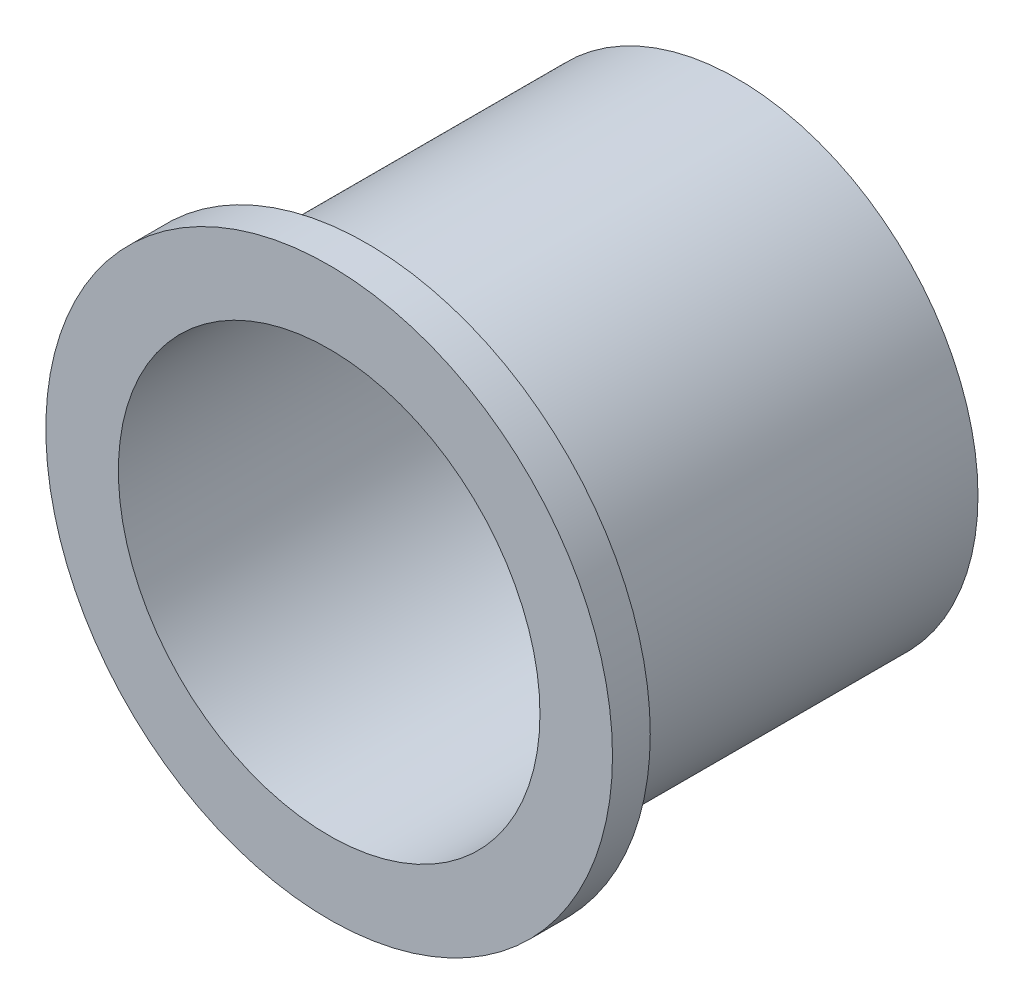
ISO-10303-21;
HEADER;
FILE_DESCRIPTION(('STEP AP214'),'2;1');
FILE_NAME('part.step','',(''),(''),'','','');
FILE_SCHEMA(('AUTOMOTIVE_DESIGN { 1 0 10303 214 1 1 1 1 }'));
ENDSEC;
DATA;
#1=APPLICATION_CONTEXT('core data for automotive mechanical design processes');
#2=APPLICATION_PROTOCOL_DEFINITION('international standard','automotive_design',2000,#1);
#3=PRODUCT_CONTEXT('',#1,'mechanical');
#4=PRODUCT('Part','Part','',(#3));
#5=PRODUCT_RELATED_PRODUCT_CATEGORY('part','',(#4));
#6=PRODUCT_DEFINITION_FORMATION('','',#4);
#7=PRODUCT_DEFINITION_CONTEXT('part definition',#1,'design');
#8=PRODUCT_DEFINITION('design','',#6,#7);
#9=PRODUCT_DEFINITION_SHAPE('','',#8);
#10=(LENGTH_UNIT() NAMED_UNIT(*) SI_UNIT(.MILLI.,.METRE.));
#11=(NAMED_UNIT(*) PLANE_ANGLE_UNIT() SI_UNIT($,.RADIAN.));
#12=(NAMED_UNIT(*) SI_UNIT($,.STERADIAN.) SOLID_ANGLE_UNIT());
#13=UNCERTAINTY_MEASURE_WITH_UNIT(LENGTH_MEASURE(1.E-05),#10,'distance_accuracy_value','');
#14=(GEOMETRIC_REPRESENTATION_CONTEXT(3) GLOBAL_UNCERTAINTY_ASSIGNED_CONTEXT((#13)) GLOBAL_UNIT_ASSIGNED_CONTEXT((#10,
#11,#12)) REPRESENTATION_CONTEXT('',''));
#15=CARTESIAN_POINT('',(0.,0.,0.));
#16=DIRECTION('',(0.,0.,1.));
#17=DIRECTION('',(1.,0.,0.));
#18=AXIS2_PLACEMENT_3D('',#15,#16,#17);
#19=CARTESIAN_POINT('',(0.,0.,0.));
#20=DIRECTION('',(0.,0.,1.));
#21=DIRECTION('',(1.,0.,0.));
#22=AXIS2_PLACEMENT_3D('',#19,#20,#21);
#23=CYLINDRICAL_SURFACE('',#22,190.5);
#24=CARTESIAN_POINT('',(0.,0.,0.));
#25=DIRECTION('',(0.,0.,1.));
#26=DIRECTION('',(1.,0.,0.));
#27=AXIS2_PLACEMENT_3D('',#24,#25,#26);
#28=CIRCLE('',#27,190.5);
#29=CARTESIAN_POINT('',(190.5,0.,0.));
#30=VERTEX_POINT('',#29);
#31=EDGE_CURVE('E10',#30,#30,#28,.T.);
#32=ORIENTED_EDGE('',*,*,#31,.F.);
#33=EDGE_LOOP('',(#32));
#34=FACE_BOUND('',#33,.T.);
#35=CARTESIAN_POINT('',(0.,0.,-25.4));
#36=DIRECTION('',(0.,0.,1.));
#37=DIRECTION('',(1.,0.,0.));
#38=AXIS2_PLACEMENT_3D('',#35,#36,#37);
#39=CIRCLE('',#38,190.5);
#40=CARTESIAN_POINT('',(190.5,0.,-25.4));
#41=VERTEX_POINT('',#40);
#42=EDGE_CURVE('E63',#41,#41,#39,.T.);
#43=ORIENTED_EDGE('',*,*,#42,.T.);
#44=EDGE_LOOP('',(#43));
#45=FACE_BOUND('',#44,.T.);
#46=ADVANCED_FACE('F41',(#34,#45),#23,.T.);
#47=CARTESIAN_POINT('',(0.,190.5,0.));
#48=DIRECTION('',(0.,0.,-1.));
#49=DIRECTION('',(-1.,0.,0.));
#50=AXIS2_PLACEMENT_3D('',#47,#48,#49);
#51=PLANE('',#50);
#52=CARTESIAN_POINT('',(0.,0.,0.));
#53=DIRECTION('',(0.,0.,1.));
#54=DIRECTION('',(1.,0.,0.));
#55=AXIS2_PLACEMENT_3D('',#52,#53,#54);
#56=CIRCLE('',#55,141.732);
#57=CARTESIAN_POINT('',(141.732,0.,0.));
#58=VERTEX_POINT('',#57);
#59=EDGE_CURVE('E47',#58,#58,#56,.T.);
#60=ORIENTED_EDGE('',*,*,#59,.F.);
#61=EDGE_LOOP('',(#60));
#62=FACE_BOUND('',#61,.T.);
#63=ORIENTED_EDGE('',*,*,#31,.T.);
#64=EDGE_LOOP('',(#63));
#65=FACE_BOUND('',#64,.T.);
#66=ADVANCED_FACE('F88',(#62,#65),#51,.F.);
#67=CARTESIAN_POINT('',(0.,0.,0.));
#68=DIRECTION('',(0.,0.,1.));
#69=DIRECTION('',(1.,0.,0.));
#70=AXIS2_PLACEMENT_3D('',#67,#68,#69);
#71=CYLINDRICAL_SURFACE('',#70,141.732);
#72=CARTESIAN_POINT('',(0.,0.,-274.32));
#73=DIRECTION('',(0.,0.,1.));
#74=DIRECTION('',(1.,0.,0.));
#75=AXIS2_PLACEMENT_3D('',#72,#73,#74);
#76=CIRCLE('',#75,141.732);
#77=CARTESIAN_POINT('',(141.732,0.,-274.32));
#78=VERTEX_POINT('',#77);
#79=EDGE_CURVE('E51',#78,#78,#76,.T.);
#80=ORIENTED_EDGE('',*,*,#79,.F.);
#81=EDGE_LOOP('',(#80));
#82=FACE_BOUND('',#81,.T.);
#83=ORIENTED_EDGE('',*,*,#59,.T.);
#84=EDGE_LOOP('',(#83));
#85=FACE_BOUND('',#84,.T.);
#86=ADVANCED_FACE('F83',(#82,#85),#71,.F.);
#87=CARTESIAN_POINT('',(0.,141.732,-274.32));
#88=DIRECTION('',(0.,0.,1.));
#89=DIRECTION('',(1.,0.,0.));
#90=AXIS2_PLACEMENT_3D('',#87,#88,#89);
#91=PLANE('',#90);
#92=CARTESIAN_POINT('',(0.,0.,-274.32));
#93=DIRECTION('',(0.,0.,1.));
#94=DIRECTION('',(1.,0.,0.));
#95=AXIS2_PLACEMENT_3D('',#92,#93,#94);
#96=CIRCLE('',#95,161.925);
#97=CARTESIAN_POINT('',(161.925,0.,-274.32));
#98=VERTEX_POINT('',#97);
#99=EDGE_CURVE('E55',#98,#98,#96,.T.);
#100=ORIENTED_EDGE('',*,*,#99,.F.);
#101=EDGE_LOOP('',(#100));
#102=FACE_BOUND('',#101,.T.);
#103=ORIENTED_EDGE('',*,*,#79,.T.);
#104=EDGE_LOOP('',(#103));
#105=FACE_BOUND('',#104,.T.);
#106=ADVANCED_FACE('F77',(#102,#105),#91,.F.);
#107=CARTESIAN_POINT('',(0.,0.,0.));
#108=DIRECTION('',(0.,0.,1.));
#109=DIRECTION('',(1.,0.,0.));
#110=AXIS2_PLACEMENT_3D('',#107,#108,#109);
#111=CYLINDRICAL_SURFACE('',#110,161.925);
#112=CARTESIAN_POINT('',(0.,0.,-25.4));
#113=DIRECTION('',(0.,0.,1.));
#114=DIRECTION('',(1.,0.,0.));
#115=AXIS2_PLACEMENT_3D('',#112,#113,#114);
#116=CIRCLE('',#115,161.925);
#117=CARTESIAN_POINT('',(161.925,0.,-25.4));
#118=VERTEX_POINT('',#117);
#119=EDGE_CURVE('E60',#118,#118,#116,.T.);
#120=ORIENTED_EDGE('',*,*,#119,.F.);
#121=EDGE_LOOP('',(#120));
#122=FACE_BOUND('',#121,.T.);
#123=ORIENTED_EDGE('',*,*,#99,.T.);
#124=EDGE_LOOP('',(#123));
#125=FACE_BOUND('',#124,.T.);
#126=ADVANCED_FACE('F71',(#122,#125),#111,.T.);
#127=CARTESIAN_POINT('',(0.,161.925,-25.4));
#128=DIRECTION('',(0.,0.,1.));
#129=DIRECTION('',(1.,0.,0.));
#130=AXIS2_PLACEMENT_3D('',#127,#128,#129);
#131=PLANE('',#130);
#132=ORIENTED_EDGE('',*,*,#42,.F.);
#133=EDGE_LOOP('',(#132));
#134=FACE_BOUND('',#133,.T.);
#135=ORIENTED_EDGE('',*,*,#119,.T.);
#136=EDGE_LOOP('',(#135));
#137=FACE_BOUND('',#136,.T.);
#138=ADVANCED_FACE('F68',(#134,#137),#131,.F.);
#139=CLOSED_SHELL('',(#46,#66,#86,#106,#126,#138));
#140=MANIFOLD_SOLID_BREP('B2',#139);
#141=ADVANCED_BREP_SHAPE_REPRESENTATION('',(#18,#140),#14);
#142=SHAPE_DEFINITION_REPRESENTATION(#9,#141);
ENDSEC;
END-ISO-10303-21;
